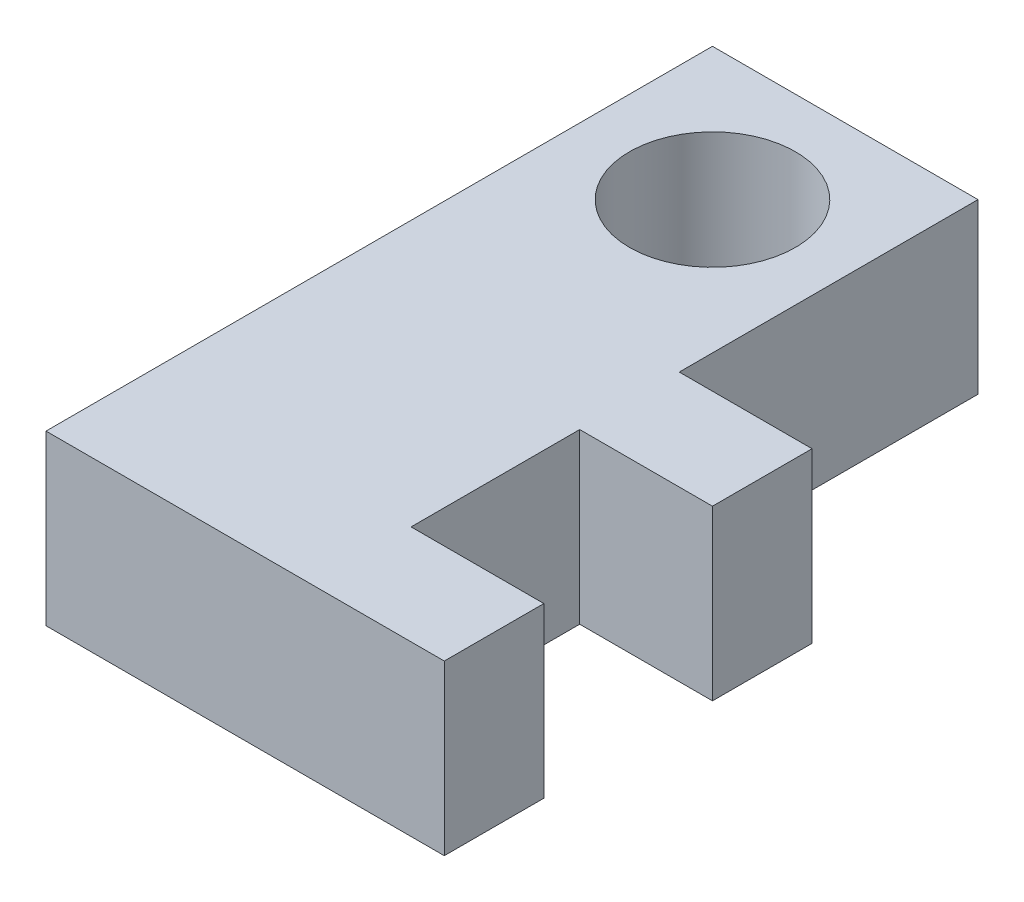
ISO-10303-21;
HEADER;
FILE_DESCRIPTION(('STEP AP214'),'2;1');
FILE_NAME('part.step','',(''),(''),'','','');
FILE_SCHEMA(('AUTOMOTIVE_DESIGN { 1 0 10303 214 1 1 1 1 }'));
ENDSEC;
DATA;
#1=APPLICATION_CONTEXT('core data for automotive mechanical design processes');
#2=APPLICATION_PROTOCOL_DEFINITION('international standard','automotive_design',2000,#1);
#3=PRODUCT_CONTEXT('',#1,'mechanical');
#4=PRODUCT('Part','Part','',(#3));
#5=PRODUCT_RELATED_PRODUCT_CATEGORY('part','',(#4));
#6=PRODUCT_DEFINITION_FORMATION('','',#4);
#7=PRODUCT_DEFINITION_CONTEXT('part definition',#1,'design');
#8=PRODUCT_DEFINITION('design','',#6,#7);
#9=PRODUCT_DEFINITION_SHAPE('','',#8);
#10=(LENGTH_UNIT() NAMED_UNIT(*) SI_UNIT(.MILLI.,.METRE.));
#11=(NAMED_UNIT(*) PLANE_ANGLE_UNIT() SI_UNIT($,.RADIAN.));
#12=(NAMED_UNIT(*) SI_UNIT($,.STERADIAN.) SOLID_ANGLE_UNIT());
#13=UNCERTAINTY_MEASURE_WITH_UNIT(LENGTH_MEASURE(1.E-05),#10,'distance_accuracy_value','');
#14=(GEOMETRIC_REPRESENTATION_CONTEXT(3) GLOBAL_UNCERTAINTY_ASSIGNED_CONTEXT((#13)) GLOBAL_UNIT_ASSIGNED_CONTEXT((#10,
#11,#12)) REPRESENTATION_CONTEXT('',''));
#15=CARTESIAN_POINT('',(0.,0.,0.));
#16=DIRECTION('',(0.,0.,1.));
#17=DIRECTION('',(1.,0.,0.));
#18=AXIS2_PLACEMENT_3D('',#15,#16,#17);
#19=CARTESIAN_POINT('',(-4.,5.08,8.));
#20=DIRECTION('',(0.,0.,-1.));
#21=DIRECTION('',(-1.,0.,0.));
#22=AXIS2_PLACEMENT_3D('',#19,#20,#21);
#23=PLANE('',#22);
#24=DIRECTION('',(0.,1.,0.));
#25=VECTOR('',#24,1.);
#26=CARTESIAN_POINT('',(4.,-14.4667342548344,8.));
#27=LINE('',#26,#25);
#28=CARTESIAN_POINT('',(4.,0.,8.));
#29=VERTEX_POINT('',#28);
#30=CARTESIAN_POINT('',(4.,5.08,8.));
#31=VERTEX_POINT('',#30);
#32=EDGE_CURVE('E50',#29,#31,#27,.T.);
#33=ORIENTED_EDGE('',*,*,#32,.F.);
#34=DIRECTION('',(1.,0.,0.));
#35=VECTOR('',#34,1.);
#36=CARTESIAN_POINT('',(-4.,0.,8.));
#37=LINE('',#36,#35);
#38=CARTESIAN_POINT('',(8.,0.,8.));
#39=VERTEX_POINT('',#38);
#40=EDGE_CURVE('E176',#29,#39,#37,.T.);
#41=ORIENTED_EDGE('',*,*,#40,.T.);
#42=DIRECTION('',(0.,1.,0.));
#43=VECTOR('',#42,1.);
#44=CARTESIAN_POINT('',(8.,-14.4667342548344,8.));
#45=LINE('',#44,#43);
#46=CARTESIAN_POINT('',(8.,5.08,8.));
#47=VERTEX_POINT('',#46);
#48=EDGE_CURVE('E170',#39,#47,#45,.T.);
#49=ORIENTED_EDGE('',*,*,#48,.T.);
#50=DIRECTION('',(1.,0.,0.));
#51=VECTOR('',#50,1.);
#52=CARTESIAN_POINT('',(-4.,5.08,8.));
#53=LINE('',#52,#51);
#54=EDGE_CURVE('E180',#31,#47,#53,.T.);
#55=ORIENTED_EDGE('',*,*,#54,.F.);
#56=EDGE_LOOP('',(#33,#41,#49,#55));
#57=FACE_BOUND('',#56,.T.);
#58=ADVANCED_FACE('F33',(#57),#23,.F.);
#59=CARTESIAN_POINT('',(4.,5.08,8.));
#60=DIRECTION('',(-1.,0.,0.));
#61=DIRECTION('',(0.,0.,1.));
#62=AXIS2_PLACEMENT_3D('',#59,#60,#61);
#63=PLANE('',#62);
#64=DIRECTION('',(0.,1.,0.));
#65=VECTOR('',#64,1.);
#66=CARTESIAN_POINT('',(4.,-14.4667342548344,5.));
#67=LINE('',#66,#65);
#68=CARTESIAN_POINT('',(4.,0.,5.));
#69=VERTEX_POINT('',#68);
#70=CARTESIAN_POINT('',(4.,5.08,5.));
#71=VERTEX_POINT('',#70);
#72=EDGE_CURVE('E58',#69,#71,#67,.T.);
#73=ORIENTED_EDGE('',*,*,#72,.F.);
#74=DIRECTION('',(0.,0.,-1.));
#75=VECTOR('',#74,1.);
#76=CARTESIAN_POINT('',(4.,0.,8.));
#77=LINE('',#76,#75);
#78=CARTESIAN_POINT('',(4.,0.,-4.));
#79=VERTEX_POINT('',#78);
#80=EDGE_CURVE('E188',#69,#79,#77,.T.);
#81=ORIENTED_EDGE('',*,*,#80,.T.);
#82=DIRECTION('',(0.,-1.,0.));
#83=VECTOR('',#82,1.);
#84=CARTESIAN_POINT('',(4.,5.08,-4.));
#85=LINE('',#84,#83);
#86=CARTESIAN_POINT('',(4.,5.08,-4.));
#87=VERTEX_POINT('',#86);
#88=EDGE_CURVE('E11',#87,#79,#85,.T.);
#89=ORIENTED_EDGE('',*,*,#88,.F.);
#90=DIRECTION('',(0.,0.,-1.));
#91=VECTOR('',#90,1.);
#92=CARTESIAN_POINT('',(4.,5.08,8.));
#93=LINE('',#92,#91);
#94=EDGE_CURVE('E165',#71,#87,#93,.T.);
#95=ORIENTED_EDGE('',*,*,#94,.F.);
#96=EDGE_LOOP('',(#73,#81,#89,#95));
#97=FACE_BOUND('',#96,.T.);
#98=ADVANCED_FACE('F35',(#97),#63,.F.);
#99=CARTESIAN_POINT('',(0.,5.08,0.));
#100=DIRECTION('',(0.,-1.,0.));
#101=DIRECTION('',(0.,0.,-1.));
#102=AXIS2_PLACEMENT_3D('',#99,#100,#101);
#103=PLANE('',#102);
#104=DIRECTION('',(0.,0.,1.));
#105=VECTOR('',#104,1.);
#106=CARTESIAN_POINT('',(-4.,5.08,8.));
#107=LINE('',#106,#105);
#108=CARTESIAN_POINT('',(-4.,5.08,-4.));
#109=VERTEX_POINT('',#108);
#110=CARTESIAN_POINT('',(-4.,5.08,16.08));
#111=VERTEX_POINT('',#110);
#112=EDGE_CURVE('E273',#109,#111,#107,.T.);
#113=ORIENTED_EDGE('',*,*,#112,.T.);
#114=DIRECTION('',(1.,0.,0.));
#115=VECTOR('',#114,1.);
#116=CARTESIAN_POINT('',(0.,5.08,16.08));
#117=LINE('',#116,#115);
#118=CARTESIAN_POINT('',(8.,5.08,16.08));
#119=VERTEX_POINT('',#118);
#120=EDGE_CURVE('E138',#111,#119,#117,.T.);
#121=ORIENTED_EDGE('',*,*,#120,.T.);
#122=DIRECTION('',(0.,0.,1.));
#123=VECTOR('',#122,1.);
#124=CARTESIAN_POINT('',(8.,5.08,0.));
#125=LINE('',#124,#123);
#126=CARTESIAN_POINT('',(8.,5.08,13.08));
#127=VERTEX_POINT('',#126);
#128=EDGE_CURVE('E123',#127,#119,#125,.T.);
#129=ORIENTED_EDGE('',*,*,#128,.F.);
#130=DIRECTION('',(1.,0.,0.));
#131=VECTOR('',#130,1.);
#132=CARTESIAN_POINT('',(0.,5.08,13.08));
#133=LINE('',#132,#131);
#134=CARTESIAN_POINT('',(4.,5.08,13.08));
#135=VERTEX_POINT('',#134);
#136=EDGE_CURVE('E119',#135,#127,#133,.T.);
#137=ORIENTED_EDGE('',*,*,#136,.F.);
#138=DIRECTION('',(0.,0.,-1.));
#139=VECTOR('',#138,1.);
#140=CARTESIAN_POINT('',(4.,5.08,0.));
#141=LINE('',#140,#139);
#142=EDGE_CURVE('E141',#135,#31,#141,.T.);
#143=ORIENTED_EDGE('',*,*,#142,.T.);
#144=ORIENTED_EDGE('',*,*,#54,.T.);
#145=DIRECTION('',(0.,0.,-1.));
#146=VECTOR('',#145,1.);
#147=CARTESIAN_POINT('',(8.,5.08,0.));
#148=LINE('',#147,#146);
#149=CARTESIAN_POINT('',(8.,5.08,5.));
#150=VERTEX_POINT('',#149);
#151=EDGE_CURVE('E151',#47,#150,#148,.T.);
#152=ORIENTED_EDGE('',*,*,#151,.T.);
#153=DIRECTION('',(1.,0.,0.));
#154=VECTOR('',#153,1.);
#155=CARTESIAN_POINT('',(0.,5.08,5.));
#156=LINE('',#155,#154);
#157=EDGE_CURVE('E164',#71,#150,#156,.T.);
#158=ORIENTED_EDGE('',*,*,#157,.F.);
#159=ORIENTED_EDGE('',*,*,#94,.T.);
#160=DIRECTION('',(-1.,0.,0.));
#161=VECTOR('',#160,1.);
#162=CARTESIAN_POINT('',(-4.,5.08,-4.));
#163=LINE('',#162,#161);
#164=EDGE_CURVE('E272',#87,#109,#163,.T.);
#165=ORIENTED_EDGE('',*,*,#164,.T.);
#166=EDGE_LOOP('',(#113,#121,#129,#137,#143,#144,#152,#158,#159,#165));
#167=FACE_BOUND('',#166,.T.);
#168=CARTESIAN_POINT('',(0.,5.08,0.));
#169=DIRECTION('',(0.,1.,0.));
#170=DIRECTION('',(0.,0.,1.));
#171=AXIS2_PLACEMENT_3D('',#168,#169,#170);
#172=CIRCLE('',#171,2.5);
#173=CARTESIAN_POINT('',(0.,5.08,2.5));
#174=VERTEX_POINT('',#173);
#175=EDGE_CURVE('E191',#174,#174,#172,.T.);
#176=ORIENTED_EDGE('',*,*,#175,.F.);
#177=EDGE_LOOP('',(#176));
#178=FACE_BOUND('',#177,.T.);
#179=ADVANCED_FACE('F217',(#167,#178),#103,.F.);
#180=CARTESIAN_POINT('',(0.,0.,0.));
#181=DIRECTION('',(0.,-1.,0.));
#182=DIRECTION('',(0.,0.,-1.));
#183=AXIS2_PLACEMENT_3D('',#180,#181,#182);
#184=PLANE('',#183);
#185=ORIENTED_EDGE('',*,*,#80,.F.);
#186=DIRECTION('',(1.,0.,0.));
#187=VECTOR('',#186,1.);
#188=CARTESIAN_POINT('',(0.,0.,5.));
#189=LINE('',#188,#187);
#190=CARTESIAN_POINT('',(8.,0.,5.));
#191=VERTEX_POINT('',#190);
#192=EDGE_CURVE('E132',#69,#191,#189,.T.);
#193=ORIENTED_EDGE('',*,*,#192,.T.);
#194=DIRECTION('',(0.,0.,-1.));
#195=VECTOR('',#194,1.);
#196=CARTESIAN_POINT('',(8.,0.,0.));
#197=LINE('',#196,#195);
#198=EDGE_CURVE('E154',#39,#191,#197,.T.);
#199=ORIENTED_EDGE('',*,*,#198,.F.);
#200=ORIENTED_EDGE('',*,*,#40,.F.);
#201=DIRECTION('',(0.,0.,-1.));
#202=VECTOR('',#201,1.);
#203=CARTESIAN_POINT('',(4.,0.,0.));
#204=LINE('',#203,#202);
#205=CARTESIAN_POINT('',(4.,0.,13.08));
#206=VERTEX_POINT('',#205);
#207=EDGE_CURVE('E137',#206,#29,#204,.T.);
#208=ORIENTED_EDGE('',*,*,#207,.F.);
#209=DIRECTION('',(1.,0.,0.));
#210=VECTOR('',#209,1.);
#211=CARTESIAN_POINT('',(0.,0.,13.08));
#212=LINE('',#211,#210);
#213=CARTESIAN_POINT('',(8.,0.,13.08));
#214=VERTEX_POINT('',#213);
#215=EDGE_CURVE('E116',#206,#214,#212,.T.);
#216=ORIENTED_EDGE('',*,*,#215,.T.);
#217=DIRECTION('',(0.,0.,1.));
#218=VECTOR('',#217,1.);
#219=CARTESIAN_POINT('',(8.,0.,0.));
#220=LINE('',#219,#218);
#221=CARTESIAN_POINT('',(8.,0.,16.08));
#222=VERTEX_POINT('',#221);
#223=EDGE_CURVE('E127',#214,#222,#220,.T.);
#224=ORIENTED_EDGE('',*,*,#223,.T.);
#225=DIRECTION('',(1.,0.,0.));
#226=VECTOR('',#225,1.);
#227=CARTESIAN_POINT('',(0.,0.,16.08));
#228=LINE('',#227,#226);
#229=CARTESIAN_POINT('',(-4.,0.,16.08));
#230=VERTEX_POINT('',#229);
#231=EDGE_CURVE('E146',#230,#222,#228,.T.);
#232=ORIENTED_EDGE('',*,*,#231,.F.);
#233=DIRECTION('',(0.,0.,1.));
#234=VECTOR('',#233,1.);
#235=CARTESIAN_POINT('',(-4.,0.,8.));
#236=LINE('',#235,#234);
#237=CARTESIAN_POINT('',(-4.,0.,-4.));
#238=VERTEX_POINT('',#237);
#239=EDGE_CURVE('E179',#238,#230,#236,.T.);
#240=ORIENTED_EDGE('',*,*,#239,.F.);
#241=DIRECTION('',(-1.,0.,0.));
#242=VECTOR('',#241,1.);
#243=CARTESIAN_POINT('',(-4.,0.,-4.));
#244=LINE('',#243,#242);
#245=EDGE_CURVE('E190',#79,#238,#244,.T.);
#246=ORIENTED_EDGE('',*,*,#245,.F.);
#247=EDGE_LOOP('',(#185,#193,#199,#200,#208,#216,#224,#232,#240,#246));
#248=FACE_BOUND('',#247,.T.);
#249=CARTESIAN_POINT('',(0.,0.,0.));
#250=DIRECTION('',(0.,1.,0.));
#251=DIRECTION('',(0.,0.,1.));
#252=AXIS2_PLACEMENT_3D('',#249,#250,#251);
#253=CIRCLE('',#252,2.5);
#254=CARTESIAN_POINT('',(0.,0.,2.5));
#255=VERTEX_POINT('',#254);
#256=EDGE_CURVE('E277',#255,#255,#253,.T.);
#257=ORIENTED_EDGE('',*,*,#256,.T.);
#258=EDGE_LOOP('',(#257));
#259=FACE_BOUND('',#258,.T.);
#260=ADVANCED_FACE('F134',(#248,#259),#184,.T.);
#261=CARTESIAN_POINT('',(-4.,5.08,-4.));
#262=DIRECTION('',(0.,0.,1.));
#263=DIRECTION('',(1.,0.,0.));
#264=AXIS2_PLACEMENT_3D('',#261,#262,#263);
#265=PLANE('',#264);
#266=ORIENTED_EDGE('',*,*,#245,.T.);
#267=DIRECTION('',(0.,-1.,0.));
#268=VECTOR('',#267,1.);
#269=CARTESIAN_POINT('',(-4.,5.08,-4.));
#270=LINE('',#269,#268);
#271=EDGE_CURVE('E42',#109,#238,#270,.T.);
#272=ORIENTED_EDGE('',*,*,#271,.F.);
#273=ORIENTED_EDGE('',*,*,#164,.F.);
#274=ORIENTED_EDGE('',*,*,#88,.T.);
#275=EDGE_LOOP('',(#266,#272,#273,#274));
#276=FACE_BOUND('',#275,.T.);
#277=ADVANCED_FACE('F240',(#276),#265,.F.);
#278=CARTESIAN_POINT('',(-4.,5.08,8.));
#279=DIRECTION('',(1.,0.,0.));
#280=DIRECTION('',(0.,0.,-1.));
#281=AXIS2_PLACEMENT_3D('',#278,#279,#280);
#282=PLANE('',#281);
#283=ORIENTED_EDGE('',*,*,#239,.T.);
#284=DIRECTION('',(0.,1.,0.));
#285=VECTOR('',#284,1.);
#286=CARTESIAN_POINT('',(-4.,-14.4667342548344,16.08));
#287=LINE('',#286,#285);
#288=EDGE_CURVE('E204',#230,#111,#287,.T.);
#289=ORIENTED_EDGE('',*,*,#288,.T.);
#290=ORIENTED_EDGE('',*,*,#112,.F.);
#291=ORIENTED_EDGE('',*,*,#271,.T.);
#292=EDGE_LOOP('',(#283,#289,#290,#291));
#293=FACE_BOUND('',#292,.T.);
#294=ADVANCED_FACE('F202',(#293),#282,.F.);
#295=CARTESIAN_POINT('',(0.,5.08,0.));
#296=DIRECTION('',(0.,-1.,0.));
#297=DIRECTION('',(0.,0.,-1.));
#298=AXIS2_PLACEMENT_3D('',#295,#296,#297);
#299=CYLINDRICAL_SURFACE('',#298,2.5);
#300=ORIENTED_EDGE('',*,*,#175,.T.);
#301=EDGE_LOOP('',(#300));
#302=FACE_BOUND('',#301,.T.);
#303=ORIENTED_EDGE('',*,*,#256,.F.);
#304=EDGE_LOOP('',(#303));
#305=FACE_BOUND('',#304,.T.);
#306=ADVANCED_FACE('F239',(#302,#305),#299,.F.);
#307=CARTESIAN_POINT('',(8.,-14.4667342548344,0.));
#308=DIRECTION('',(1.,0.,0.));
#309=DIRECTION('',(0.,0.,-1.));
#310=AXIS2_PLACEMENT_3D('',#307,#308,#309);
#311=PLANE('',#310);
#312=ORIENTED_EDGE('',*,*,#48,.F.);
#313=ORIENTED_EDGE('',*,*,#198,.T.);
#314=DIRECTION('',(0.,1.,0.));
#315=VECTOR('',#314,1.);
#316=CARTESIAN_POINT('',(8.,-14.4667342548344,5.));
#317=LINE('',#316,#315);
#318=EDGE_CURVE('E157',#191,#150,#317,.T.);
#319=ORIENTED_EDGE('',*,*,#318,.T.);
#320=ORIENTED_EDGE('',*,*,#151,.F.);
#321=EDGE_LOOP('',(#312,#313,#319,#320));
#322=FACE_BOUND('',#321,.T.);
#323=ADVANCED_FACE('F253',(#322),#311,.T.);
#324=CARTESIAN_POINT('',(0.,-14.4667342548344,5.));
#325=DIRECTION('',(0.,0.,1.));
#326=DIRECTION('',(1.,0.,0.));
#327=AXIS2_PLACEMENT_3D('',#324,#325,#326);
#328=PLANE('',#327);
#329=ORIENTED_EDGE('',*,*,#192,.F.);
#330=ORIENTED_EDGE('',*,*,#72,.T.);
#331=ORIENTED_EDGE('',*,*,#157,.T.);
#332=ORIENTED_EDGE('',*,*,#318,.F.);
#333=EDGE_LOOP('',(#329,#330,#331,#332));
#334=FACE_BOUND('',#333,.T.);
#335=ADVANCED_FACE('F257',(#334),#328,.F.);
#336=CARTESIAN_POINT('',(8.,-14.4667342548344,0.));
#337=DIRECTION('',(-1.,0.,0.));
#338=DIRECTION('',(0.,0.,1.));
#339=AXIS2_PLACEMENT_3D('',#336,#337,#338);
#340=PLANE('',#339);
#341=ORIENTED_EDGE('',*,*,#223,.F.);
#342=DIRECTION('',(0.,1.,0.));
#343=VECTOR('',#342,1.);
#344=CARTESIAN_POINT('',(8.,-14.4667342548344,13.08));
#345=LINE('',#344,#343);
#346=EDGE_CURVE('E112',#214,#127,#345,.T.);
#347=ORIENTED_EDGE('',*,*,#346,.T.);
#348=ORIENTED_EDGE('',*,*,#128,.T.);
#349=DIRECTION('',(0.,1.,0.));
#350=VECTOR('',#349,1.);
#351=CARTESIAN_POINT('',(8.,-14.4667342548344,16.08));
#352=LINE('',#351,#350);
#353=EDGE_CURVE('E129',#222,#119,#352,.T.);
#354=ORIENTED_EDGE('',*,*,#353,.F.);
#355=EDGE_LOOP('',(#341,#347,#348,#354));
#356=FACE_BOUND('',#355,.T.);
#357=ADVANCED_FACE('F128',(#356),#340,.F.);
#358=CARTESIAN_POINT('',(0.,-14.4667342548344,16.08));
#359=DIRECTION('',(0.,0.,1.));
#360=DIRECTION('',(1.,0.,0.));
#361=AXIS2_PLACEMENT_3D('',#358,#359,#360);
#362=PLANE('',#361);
#363=ORIENTED_EDGE('',*,*,#288,.F.);
#364=ORIENTED_EDGE('',*,*,#231,.T.);
#365=ORIENTED_EDGE('',*,*,#353,.T.);
#366=ORIENTED_EDGE('',*,*,#120,.F.);
#367=EDGE_LOOP('',(#363,#364,#365,#366));
#368=FACE_BOUND('',#367,.T.);
#369=ADVANCED_FACE('F207',(#368),#362,.T.);
#370=CARTESIAN_POINT('',(4.,-14.4667342548344,0.));
#371=DIRECTION('',(1.,0.,0.));
#372=DIRECTION('',(0.,0.,-1.));
#373=AXIS2_PLACEMENT_3D('',#370,#371,#372);
#374=PLANE('',#373);
#375=DIRECTION('',(0.,1.,0.));
#376=VECTOR('',#375,1.);
#377=CARTESIAN_POINT('',(4.,-14.4667342548344,13.08));
#378=LINE('',#377,#376);
#379=EDGE_CURVE('E149',#206,#135,#378,.T.);
#380=ORIENTED_EDGE('',*,*,#379,.F.);
#381=ORIENTED_EDGE('',*,*,#207,.T.);
#382=ORIENTED_EDGE('',*,*,#32,.T.);
#383=ORIENTED_EDGE('',*,*,#142,.F.);
#384=EDGE_LOOP('',(#380,#381,#382,#383));
#385=FACE_BOUND('',#384,.T.);
#386=ADVANCED_FACE('F221',(#385),#374,.T.);
#387=CARTESIAN_POINT('',(0.,-14.4667342548344,13.08));
#388=DIRECTION('',(0.,0.,1.));
#389=DIRECTION('',(1.,0.,0.));
#390=AXIS2_PLACEMENT_3D('',#387,#388,#389);
#391=PLANE('',#390);
#392=ORIENTED_EDGE('',*,*,#215,.F.);
#393=ORIENTED_EDGE('',*,*,#379,.T.);
#394=ORIENTED_EDGE('',*,*,#136,.T.);
#395=ORIENTED_EDGE('',*,*,#346,.F.);
#396=EDGE_LOOP('',(#392,#393,#394,#395));
#397=FACE_BOUND('',#396,.T.);
#398=ADVANCED_FACE('F114',(#397),#391,.F.);
#399=CLOSED_SHELL('',(#58,#98,#179,#260,#277,#294,#306,#323,#335,#357,#369,#386,#398));
#400=MANIFOLD_SOLID_BREP('B2',#399);
#401=ADVANCED_BREP_SHAPE_REPRESENTATION('',(#18,#400),#14);
#402=SHAPE_DEFINITION_REPRESENTATION(#9,#401);
ENDSEC;
END-ISO-10303-21;
